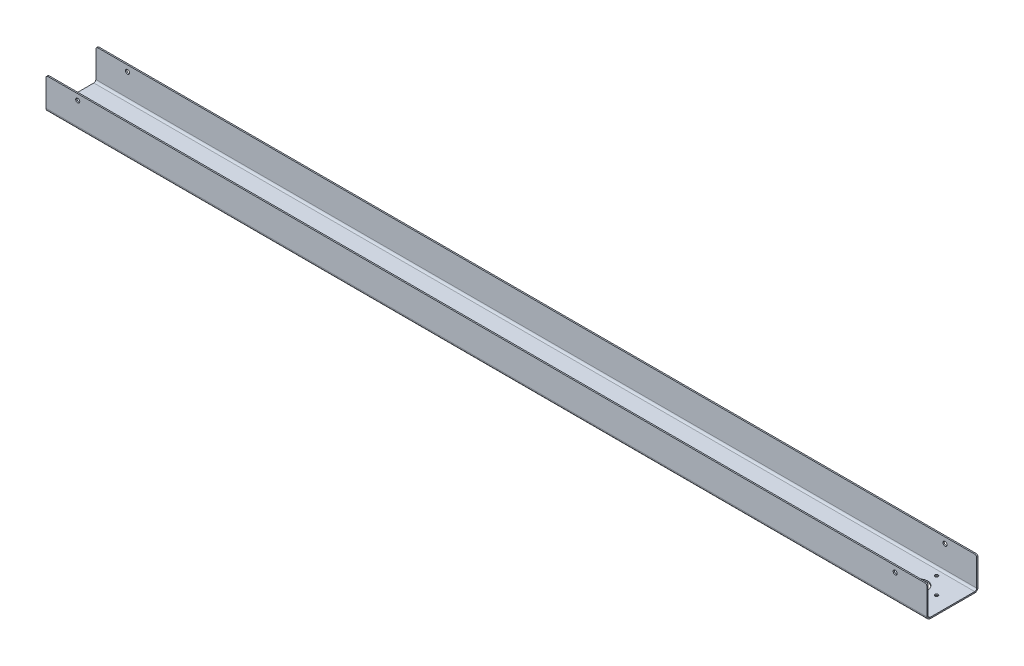
ISO-10303-21;
HEADER;
FILE_DESCRIPTION(('STEP AP214'),'2;1');
FILE_NAME('part.step','',(''),(''),'','','');
FILE_SCHEMA(('AUTOMOTIVE_DESIGN { 1 0 10303 214 1 1 1 1 }'));
ENDSEC;
DATA;
#1=APPLICATION_CONTEXT('core data for automotive mechanical design processes');
#2=APPLICATION_PROTOCOL_DEFINITION('international standard','automotive_design',2000,#1);
#3=PRODUCT_CONTEXT('',#1,'mechanical');
#4=PRODUCT('Part','Part','',(#3));
#5=PRODUCT_RELATED_PRODUCT_CATEGORY('part','',(#4));
#6=PRODUCT_DEFINITION_FORMATION('','',#4);
#7=PRODUCT_DEFINITION_CONTEXT('part definition',#1,'design');
#8=PRODUCT_DEFINITION('design','',#6,#7);
#9=PRODUCT_DEFINITION_SHAPE('','',#8);
#10=(LENGTH_UNIT() NAMED_UNIT(*) SI_UNIT(.MILLI.,.METRE.));
#11=(NAMED_UNIT(*) PLANE_ANGLE_UNIT() SI_UNIT($,.RADIAN.));
#12=(NAMED_UNIT(*) SI_UNIT($,.STERADIAN.) SOLID_ANGLE_UNIT());
#13=UNCERTAINTY_MEASURE_WITH_UNIT(LENGTH_MEASURE(1.E-05),#10,'distance_accuracy_value','');
#14=(GEOMETRIC_REPRESENTATION_CONTEXT(3) GLOBAL_UNCERTAINTY_ASSIGNED_CONTEXT((#13)) GLOBAL_UNIT_ASSIGNED_CONTEXT((#10,
#11,#12)) REPRESENTATION_CONTEXT('',''));
#15=CARTESIAN_POINT('',(0.,0.,0.));
#16=DIRECTION('',(0.,0.,1.));
#17=DIRECTION('',(1.,0.,0.));
#18=AXIS2_PLACEMENT_3D('',#15,#16,#17);
#19=CARTESIAN_POINT('',(0.,-2.052574,0.));
#20=DIRECTION('',(0.,-1.,0.));
#21=DIRECTION('',(0.,0.,-1.));
#22=AXIS2_PLACEMENT_3D('',#19,#20,#21);
#23=PLANE('',#22);
#24=CARTESIAN_POINT('',(1357.3125,-2.052574,-40.878125));
#25=DIRECTION('',(0.,-1.,0.));
#26=DIRECTION('',(0.,0.,-1.));
#27=AXIS2_PLACEMENT_3D('',#24,#25,#26);
#28=CIRCLE('',#27,12.6999999999999);
#29=CARTESIAN_POINT('',(1357.3125,-2.052574,-53.5781249999999));
#30=VERTEX_POINT('',#29);
#31=EDGE_CURVE('E847',#30,#30,#28,.T.);
#32=ORIENTED_EDGE('',*,*,#31,.F.);
#33=EDGE_LOOP('',(#32));
#34=FACE_BOUND('',#33,.T.);
#35=CARTESIAN_POINT('',(1384.3,-2.052574,-40.8781249999999));
#36=DIRECTION('',(0.,-1.,0.));
#37=DIRECTION('',(0.,0.,-1.));
#38=AXIS2_PLACEMENT_3D('',#35,#36,#37);
#39=CIRCLE('',#38,2.55270000000007);
#40=CARTESIAN_POINT('',(1384.3,-2.052574,-43.430825));
#41=VERTEX_POINT('',#40);
#42=EDGE_CURVE('E798',#41,#41,#39,.T.);
#43=ORIENTED_EDGE('',*,*,#42,.F.);
#44=EDGE_LOOP('',(#43));
#45=FACE_BOUND('',#44,.T.);
#46=CARTESIAN_POINT('',(1330.325,-2.052574,-40.878125));
#47=DIRECTION('',(0.,-1.,0.));
#48=DIRECTION('',(0.,0.,-1.));
#49=AXIS2_PLACEMENT_3D('',#46,#47,#48);
#50=CIRCLE('',#49,2.55270000000007);
#51=CARTESIAN_POINT('',(1330.325,-2.052574,-43.430825));
#52=VERTEX_POINT('',#51);
#53=EDGE_CURVE('E320',#52,#52,#50,.T.);
#54=ORIENTED_EDGE('',*,*,#53,.F.);
#55=EDGE_LOOP('',(#54));
#56=FACE_BOUND('',#55,.T.);
#57=CARTESIAN_POINT('',(1357.3125,-2.052574,-67.8656249999999));
#58=DIRECTION('',(0.,-1.,0.));
#59=DIRECTION('',(0.,0.,-1.));
#60=AXIS2_PLACEMENT_3D('',#57,#58,#59);
#61=CIRCLE('',#60,2.55270000000007);
#62=CARTESIAN_POINT('',(1357.3125,-2.052574,-70.418325));
#63=VERTEX_POINT('',#62);
#64=EDGE_CURVE('E319',#63,#63,#61,.T.);
#65=ORIENTED_EDGE('',*,*,#64,.F.);
#66=EDGE_LOOP('',(#65));
#67=FACE_BOUND('',#66,.T.);
#68=CARTESIAN_POINT('',(1357.3125,-2.052574,-13.890625));
#69=DIRECTION('',(0.,-1.,0.));
#70=DIRECTION('',(0.,0.,-1.));
#71=AXIS2_PLACEMENT_3D('',#68,#69,#70);
#72=CIRCLE('',#71,2.55270000000007);
#73=CARTESIAN_POINT('',(1357.3125,-2.052574,-16.4433250000001));
#74=VERTEX_POINT('',#73);
#75=EDGE_CURVE('E811',#74,#74,#72,.T.);
#76=ORIENTED_EDGE('',*,*,#75,.F.);
#77=EDGE_LOOP('',(#76));
#78=FACE_BOUND('',#77,.T.);
#79=DIRECTION('',(0.,0.,1.));
#80=VECTOR('',#79,1.);
#81=CARTESIAN_POINT('',(0.,-2.052574,0.));
#82=LINE('',#81,#80);
#83=CARTESIAN_POINT('',(0.,-2.05257400000005,-76.528676));
#84=VERTEX_POINT('',#83);
#85=CARTESIAN_POINT('',(0.,-2.052574,-5.22757399999961));
#86=VERTEX_POINT('',#85);
#87=EDGE_CURVE('E304',#84,#86,#82,.T.);
#88=ORIENTED_EDGE('',*,*,#87,.F.);
#89=DIRECTION('',(-1.,0.,0.));
#90=VECTOR('',#89,1.);
#91=CARTESIAN_POINT('',(0.,-2.05257400000005,-76.528676));
#92=LINE('',#91,#90);
#93=CARTESIAN_POINT('',(1409.7,-2.052574,-76.528676));
#94=VERTEX_POINT('',#93);
#95=EDGE_CURVE('E201',#84,#94,#92,.F.);
#96=ORIENTED_EDGE('',*,*,#95,.T.);
#97=DIRECTION('',(0.,0.,-1.));
#98=VECTOR('',#97,1.);
#99=CARTESIAN_POINT('',(1409.7,-2.052574,0.));
#100=LINE('',#99,#98);
#101=CARTESIAN_POINT('',(1409.7,-2.05257399999982,-5.22757399999987));
#102=VERTEX_POINT('',#101);
#103=EDGE_CURVE('E307',#102,#94,#100,.T.);
#104=ORIENTED_EDGE('',*,*,#103,.F.);
#105=DIRECTION('',(1.,0.,0.));
#106=VECTOR('',#105,1.);
#107=CARTESIAN_POINT('',(1409.7,-2.05257399999982,-5.22757399999987));
#108=LINE('',#107,#106);
#109=EDGE_CURVE('E281',#102,#86,#108,.F.);
#110=ORIENTED_EDGE('',*,*,#109,.T.);
#111=EDGE_LOOP('',(#88,#96,#104,#110));
#112=FACE_BOUND('',#111,.T.);
#113=ADVANCED_FACE('F78',(#34,#45,#56,#67,#78,#112),#23,.T.);
#114=CARTESIAN_POINT('',(0.,0.,0.));
#115=DIRECTION('',(0.,-1.,0.));
#116=DIRECTION('',(0.,0.,-1.));
#117=AXIS2_PLACEMENT_3D('',#114,#115,#116);
#118=PLANE('',#117);
#119=CARTESIAN_POINT('',(1357.3125,0.,-40.878125));
#120=DIRECTION('',(0.,-1.,0.));
#121=DIRECTION('',(0.,0.,-1.));
#122=AXIS2_PLACEMENT_3D('',#119,#120,#121);
#123=CIRCLE('',#122,12.6999999999999);
#124=CARTESIAN_POINT('',(1357.3125,0.,-53.5781249999999));
#125=VERTEX_POINT('',#124);
#126=EDGE_CURVE('E781',#125,#125,#123,.T.);
#127=ORIENTED_EDGE('',*,*,#126,.T.);
#128=EDGE_LOOP('',(#127));
#129=FACE_BOUND('',#128,.T.);
#130=CARTESIAN_POINT('',(1384.3,0.,-40.8781249999999));
#131=DIRECTION('',(0.,-1.,0.));
#132=DIRECTION('',(0.,0.,-1.));
#133=AXIS2_PLACEMENT_3D('',#130,#131,#132);
#134=CIRCLE('',#133,2.55270000000007);
#135=CARTESIAN_POINT('',(1384.3,0.,-43.430825));
#136=VERTEX_POINT('',#135);
#137=EDGE_CURVE('E801',#136,#136,#134,.T.);
#138=ORIENTED_EDGE('',*,*,#137,.T.);
#139=EDGE_LOOP('',(#138));
#140=FACE_BOUND('',#139,.T.);
#141=CARTESIAN_POINT('',(1330.325,0.,-40.878125));
#142=DIRECTION('',(0.,-1.,0.));
#143=DIRECTION('',(0.,0.,-1.));
#144=AXIS2_PLACEMENT_3D('',#141,#142,#143);
#145=CIRCLE('',#144,2.55270000000007);
#146=CARTESIAN_POINT('',(1330.325,0.,-43.430825));
#147=VERTEX_POINT('',#146);
#148=EDGE_CURVE('E316',#147,#147,#145,.T.);
#149=ORIENTED_EDGE('',*,*,#148,.T.);
#150=EDGE_LOOP('',(#149));
#151=FACE_BOUND('',#150,.T.);
#152=CARTESIAN_POINT('',(1357.3125,0.,-67.8656249999999));
#153=DIRECTION('',(0.,-1.,0.));
#154=DIRECTION('',(0.,0.,-1.));
#155=AXIS2_PLACEMENT_3D('',#152,#153,#154);
#156=CIRCLE('',#155,2.55270000000007);
#157=CARTESIAN_POINT('',(1357.3125,0.,-70.418325));
#158=VERTEX_POINT('',#157);
#159=EDGE_CURVE('E808',#158,#158,#156,.T.);
#160=ORIENTED_EDGE('',*,*,#159,.T.);
#161=EDGE_LOOP('',(#160));
#162=FACE_BOUND('',#161,.T.);
#163=CARTESIAN_POINT('',(1357.3125,0.,-13.890625));
#164=DIRECTION('',(0.,-1.,0.));
#165=DIRECTION('',(0.,0.,-1.));
#166=AXIS2_PLACEMENT_3D('',#163,#164,#165);
#167=CIRCLE('',#166,2.55270000000007);
#168=CARTESIAN_POINT('',(1357.3125,0.,-16.4433250000001));
#169=VERTEX_POINT('',#168);
#170=EDGE_CURVE('E239',#169,#169,#167,.T.);
#171=ORIENTED_EDGE('',*,*,#170,.T.);
#172=EDGE_LOOP('',(#171));
#173=FACE_BOUND('',#172,.T.);
#174=DIRECTION('',(-1.,0.,0.));
#175=VECTOR('',#174,1.);
#176=CARTESIAN_POINT('',(0.,0.,-76.528676));
#177=LINE('',#176,#175);
#178=CARTESIAN_POINT('',(0.,0.,-76.528676));
#179=VERTEX_POINT('',#178);
#180=CARTESIAN_POINT('',(1409.7,0.,-76.528676));
#181=VERTEX_POINT('',#180);
#182=EDGE_CURVE('E246',#179,#181,#177,.F.);
#183=ORIENTED_EDGE('',*,*,#182,.F.);
#184=DIRECTION('',(0.,0.,1.));
#185=VECTOR('',#184,1.);
#186=CARTESIAN_POINT('',(0.,0.,0.));
#187=LINE('',#186,#185);
#188=CARTESIAN_POINT('',(0.,1.81278603239576E-13,-5.22757399999961));
#189=VERTEX_POINT('',#188);
#190=EDGE_CURVE('E301',#179,#189,#187,.T.);
#191=ORIENTED_EDGE('',*,*,#190,.T.);
#192=DIRECTION('',(1.,0.,0.));
#193=VECTOR('',#192,1.);
#194=CARTESIAN_POINT('',(1409.7,1.81278603239576E-13,-5.22757399999999));
#195=LINE('',#194,#193);
#196=CARTESIAN_POINT('',(1409.7,1.81278603239576E-13,-5.22757399999999));
#197=VERTEX_POINT('',#196);
#198=EDGE_CURVE('E294',#197,#189,#195,.F.);
#199=ORIENTED_EDGE('',*,*,#198,.F.);
#200=DIRECTION('',(0.,0.,-1.));
#201=VECTOR('',#200,1.);
#202=CARTESIAN_POINT('',(1409.7,0.,0.));
#203=LINE('',#202,#201);
#204=EDGE_CURVE('E308',#197,#181,#203,.T.);
#205=ORIENTED_EDGE('',*,*,#204,.T.);
#206=EDGE_LOOP('',(#183,#191,#199,#205));
#207=FACE_BOUND('',#206,.T.);
#208=ADVANCED_FACE('F383',(#129,#140,#151,#162,#173,#207),#118,.F.);
#209=CARTESIAN_POINT('',(0.,-2.052574,0.));
#210=DIRECTION('',(-1.,0.,0.));
#211=DIRECTION('',(0.,0.,1.));
#212=AXIS2_PLACEMENT_3D('',#209,#210,#211);
#213=PLANE('',#212);
#214=ORIENTED_EDGE('',*,*,#190,.F.);
#215=DIRECTION('',(0.,-1.,0.));
#216=VECTOR('',#215,1.);
#217=CARTESIAN_POINT('',(0.,0.,-76.528676));
#218=LINE('',#217,#216);
#219=EDGE_CURVE('E242',#179,#84,#218,.T.);
#220=ORIENTED_EDGE('',*,*,#219,.T.);
#221=ORIENTED_EDGE('',*,*,#87,.T.);
#222=DIRECTION('',(0.,-1.,0.));
#223=VECTOR('',#222,1.);
#224=CARTESIAN_POINT('',(0.,1.81278603239576E-13,-5.22757399999961));
#225=LINE('',#224,#223);
#226=EDGE_CURVE('E298',#189,#86,#225,.T.);
#227=ORIENTED_EDGE('',*,*,#226,.F.);
#228=EDGE_LOOP('',(#214,#220,#221,#227));
#229=FACE_BOUND('',#228,.T.);
#230=ADVANCED_FACE('F437',(#229),#213,.T.);
#231=CARTESIAN_POINT('',(1409.7,-2.052574,0.));
#232=DIRECTION('',(1.,0.,0.));
#233=DIRECTION('',(0.,0.,-1.));
#234=AXIS2_PLACEMENT_3D('',#231,#232,#233);
#235=PLANE('',#234);
#236=DIRECTION('',(0.,-1.,0.));
#237=VECTOR('',#236,1.);
#238=CARTESIAN_POINT('',(1409.7,0.,-76.528676));
#239=LINE('',#238,#237);
#240=EDGE_CURVE('E249',#181,#94,#239,.T.);
#241=ORIENTED_EDGE('',*,*,#240,.F.);
#242=ORIENTED_EDGE('',*,*,#204,.F.);
#243=DIRECTION('',(0.,-1.,0.));
#244=VECTOR('',#243,1.);
#245=CARTESIAN_POINT('',(1409.7,1.81278603239576E-13,-5.22757399999999));
#246=LINE('',#245,#244);
#247=EDGE_CURVE('E288',#197,#102,#246,.T.);
#248=ORIENTED_EDGE('',*,*,#247,.T.);
#249=ORIENTED_EDGE('',*,*,#103,.T.);
#250=EDGE_LOOP('',(#241,#242,#248,#249));
#251=FACE_BOUND('',#250,.T.);
#252=ADVANCED_FACE('F379',(#251),#235,.T.);
#253=CARTESIAN_POINT('',(0.,3.17499999999999,-5.2275739999998));
#254=DIRECTION('',(-1.,0.,0.));
#255=DIRECTION('',(0.,0.,1.));
#256=AXIS2_PLACEMENT_3D('',#253,#254,#255);
#257=PLANE('',#256);
#258=DIRECTION('',(0.,0.,-1.));
#259=VECTOR('',#258,1.);
#260=CARTESIAN_POINT('',(0.,3.17499999999999,0.));
#261=LINE('',#260,#259);
#262=CARTESIAN_POINT('',(0.,3.17499999999999,-2.05257399999999));
#263=VERTEX_POINT('',#262);
#264=CARTESIAN_POINT('',(0.,3.17499999999999,0.));
#265=VERTEX_POINT('',#264);
#266=EDGE_CURVE('E252',#263,#265,#261,.F.);
#267=ORIENTED_EDGE('',*,*,#266,.F.);
#268=CARTESIAN_POINT('',(0.,3.17499999999999,-5.2275739999998));
#269=DIRECTION('',(1.,0.,0.));
#270=DIRECTION('',(0.,0.,-1.));
#271=AXIS2_PLACEMENT_3D('',#268,#269,#270);
#272=CIRCLE('',#271,3.17499999999981);
#273=EDGE_CURVE('E291',#189,#263,#272,.F.);
#274=ORIENTED_EDGE('',*,*,#273,.F.);
#275=ORIENTED_EDGE('',*,*,#226,.T.);
#276=CARTESIAN_POINT('',(0.,3.17499999999999,-5.2275739999998));
#277=DIRECTION('',(1.,0.,0.));
#278=DIRECTION('',(0.,0.,-1.));
#279=AXIS2_PLACEMENT_3D('',#276,#277,#278);
#280=CIRCLE('',#279,5.22757399999981);
#281=EDGE_CURVE('E284',#86,#265,#280,.F.);
#282=ORIENTED_EDGE('',*,*,#281,.T.);
#283=EDGE_LOOP('',(#267,#274,#275,#282));
#284=FACE_BOUND('',#283,.T.);
#285=ADVANCED_FACE('F393',(#284),#257,.T.);
#286=CARTESIAN_POINT('',(1409.7,3.17499999999999,-5.22757400000019));
#287=DIRECTION('',(-1.,0.,0.));
#288=DIRECTION('',(0.,0.,1.));
#289=AXIS2_PLACEMENT_3D('',#286,#287,#288);
#290=PLANE('',#289);
#291=CARTESIAN_POINT('',(1409.7,3.17499999999999,-5.22757400000019));
#292=DIRECTION('',(1.,0.,0.));
#293=DIRECTION('',(0.,0.,-1.));
#294=AXIS2_PLACEMENT_3D('',#291,#292,#293);
#295=CIRCLE('',#294,3.17499999999981);
#296=CARTESIAN_POINT('',(1409.7,3.17499999999999,-2.05257400000038));
#297=VERTEX_POINT('',#296);
#298=EDGE_CURVE('E257',#297,#197,#295,.T.);
#299=ORIENTED_EDGE('',*,*,#298,.F.);
#300=DIRECTION('',(0.,0.,-1.));
#301=VECTOR('',#300,1.);
#302=CARTESIAN_POINT('',(1409.7,3.17499999999999,-2.05257399999999));
#303=LINE('',#302,#301);
#304=CARTESIAN_POINT('',(1409.7,3.17499999999999,0.));
#305=VERTEX_POINT('',#304);
#306=EDGE_CURVE('E274',#297,#305,#303,.F.);
#307=ORIENTED_EDGE('',*,*,#306,.T.);
#308=CARTESIAN_POINT('',(1409.7,3.17499999999999,-5.22757400000019));
#309=DIRECTION('',(1.,0.,0.));
#310=DIRECTION('',(0.,0.,-1.));
#311=AXIS2_PLACEMENT_3D('',#308,#309,#310);
#312=CIRCLE('',#311,5.22757399999981);
#313=EDGE_CURVE('E285',#305,#102,#312,.T.);
#314=ORIENTED_EDGE('',*,*,#313,.T.);
#315=ORIENTED_EDGE('',*,*,#247,.F.);
#316=EDGE_LOOP('',(#299,#307,#314,#315));
#317=FACE_BOUND('',#316,.T.);
#318=ADVANCED_FACE('F405',(#317),#290,.F.);
#319=CARTESIAN_POINT('',(1409.7,3.17499999999999,-5.22757400000019));
#320=DIRECTION('',(1.,0.,0.));
#321=DIRECTION('',(0.,0.,1.));
#322=AXIS2_PLACEMENT_3D('',#319,#320,#321);
#323=CYLINDRICAL_SURFACE('',#322,5.22757399999981);
#324=ORIENTED_EDGE('',*,*,#109,.F.);
#325=ORIENTED_EDGE('',*,*,#313,.F.);
#326=DIRECTION('',(1.,0.,0.));
#327=VECTOR('',#326,1.);
#328=CARTESIAN_POINT('',(0.,3.17499999999999,0.));
#329=LINE('',#328,#327);
#330=EDGE_CURVE('E271',#305,#265,#329,.F.);
#331=ORIENTED_EDGE('',*,*,#330,.T.);
#332=ORIENTED_EDGE('',*,*,#281,.F.);
#333=EDGE_LOOP('',(#324,#325,#331,#332));
#334=FACE_BOUND('',#333,.T.);
#335=ADVANCED_FACE('F507',(#334),#323,.T.);
#336=CARTESIAN_POINT('',(1409.7,3.17499999999999,-5.22757400000019));
#337=DIRECTION('',(1.,0.,0.));
#338=DIRECTION('',(0.,0.,1.));
#339=AXIS2_PLACEMENT_3D('',#336,#337,#338);
#340=CYLINDRICAL_SURFACE('',#339,3.17499999999981);
#341=ORIENTED_EDGE('',*,*,#198,.T.);
#342=ORIENTED_EDGE('',*,*,#273,.T.);
#343=DIRECTION('',(1.,0.,0.));
#344=VECTOR('',#343,1.);
#345=CARTESIAN_POINT('',(0.,3.17499999999999,-2.05257399999999));
#346=LINE('',#345,#344);
#347=EDGE_CURVE('E277',#263,#297,#346,.T.);
#348=ORIENTED_EDGE('',*,*,#347,.T.);
#349=ORIENTED_EDGE('',*,*,#298,.T.);
#350=EDGE_LOOP('',(#341,#342,#348,#349));
#351=FACE_BOUND('',#350,.T.);
#352=ADVANCED_FACE('F388',(#351),#340,.F.);
#353=CARTESIAN_POINT('',(0.,0.,0.));
#354=DIRECTION('',(1.,0.,0.));
#355=DIRECTION('',(0.,0.,-1.));
#356=AXIS2_PLACEMENT_3D('',#353,#354,#355);
#357=PLANE('',#356);
#358=DIRECTION('',(0.,-1.,0.));
#359=VECTOR('',#358,1.);
#360=CARTESIAN_POINT('',(0.,0.,0.));
#361=LINE('',#360,#359);
#362=CARTESIAN_POINT('',(0.,45.572426,0.));
#363=VERTEX_POINT('',#362);
#364=EDGE_CURVE('E261',#363,#265,#361,.T.);
#365=ORIENTED_EDGE('',*,*,#364,.F.);
#366=DIRECTION('',(0.,0.,-1.));
#367=VECTOR('',#366,1.);
#368=CARTESIAN_POINT('',(0.,45.572426,0.));
#369=LINE('',#368,#367);
#370=CARTESIAN_POINT('',(0.,45.572426,-2.052574));
#371=VERTEX_POINT('',#370);
#372=EDGE_CURVE('E13',#363,#371,#369,.T.);
#373=ORIENTED_EDGE('',*,*,#372,.T.);
#374=DIRECTION('',(0.,1.,0.));
#375=VECTOR('',#374,1.);
#376=CARTESIAN_POINT('',(0.,0.,-2.052574));
#377=LINE('',#376,#375);
#378=EDGE_CURVE('E269',#371,#263,#377,.F.);
#379=ORIENTED_EDGE('',*,*,#378,.T.);
#380=ORIENTED_EDGE('',*,*,#266,.T.);
#381=EDGE_LOOP('',(#365,#373,#379,#380));
#382=FACE_BOUND('',#381,.T.);
#383=ADVANCED_FACE('F396',(#382),#357,.F.);
#384=CARTESIAN_POINT('',(1409.7,48.747426,0.));
#385=DIRECTION('',(-1.,0.,0.));
#386=DIRECTION('',(0.,0.,1.));
#387=AXIS2_PLACEMENT_3D('',#384,#385,#386);
#388=PLANE('',#387);
#389=DIRECTION('',(0.,-1.,0.));
#390=VECTOR('',#389,1.);
#391=CARTESIAN_POINT('',(1409.7,48.747426,-2.052574));
#392=LINE('',#391,#390);
#393=CARTESIAN_POINT('',(1409.7,45.572426,-2.052574));
#394=VERTEX_POINT('',#393);
#395=EDGE_CURVE('E266',#297,#394,#392,.F.);
#396=ORIENTED_EDGE('',*,*,#395,.T.);
#397=DIRECTION('',(0.,0.,-1.));
#398=VECTOR('',#397,1.);
#399=CARTESIAN_POINT('',(1409.7,45.572426,0.));
#400=LINE('',#399,#398);
#401=CARTESIAN_POINT('',(1409.7,45.572426,0.));
#402=VERTEX_POINT('',#401);
#403=EDGE_CURVE('E334',#394,#402,#400,.F.);
#404=ORIENTED_EDGE('',*,*,#403,.T.);
#405=DIRECTION('',(0.,1.,0.));
#406=VECTOR('',#405,1.);
#407=CARTESIAN_POINT('',(1409.7,0.,0.));
#408=LINE('',#407,#406);
#409=EDGE_CURVE('E258',#305,#402,#408,.T.);
#410=ORIENTED_EDGE('',*,*,#409,.F.);
#411=ORIENTED_EDGE('',*,*,#306,.F.);
#412=EDGE_LOOP('',(#396,#404,#410,#411));
#413=FACE_BOUND('',#412,.T.);
#414=ADVANCED_FACE('F409',(#413),#388,.F.);
#415=CARTESIAN_POINT('',(0.,0.,0.));
#416=DIRECTION('',(0.,0.,-1.));
#417=DIRECTION('',(-1.,0.,0.));
#418=AXIS2_PLACEMENT_3D('',#415,#416,#417);
#419=PLANE('',#418);
#420=CARTESIAN_POINT('',(1358.9,39.222426,0.));
#421=DIRECTION('',(0.,0.,1.));
#422=DIRECTION('',(1.,0.,0.));
#423=AXIS2_PLACEMENT_3D('',#420,#421,#422);
#424=CIRCLE('',#423,3.2639000000001);
#425=CARTESIAN_POINT('',(1362.1639,39.222426,0.));
#426=VERTEX_POINT('',#425);
#427=EDGE_CURVE('E778',#426,#426,#424,.T.);
#428=ORIENTED_EDGE('',*,*,#427,.F.);
#429=EDGE_LOOP('',(#428));
#430=FACE_BOUND('',#429,.T.);
#431=CARTESIAN_POINT('',(50.8,39.222426,0.));
#432=DIRECTION('',(0.,0.,1.));
#433=DIRECTION('',(1.,0.,0.));
#434=AXIS2_PLACEMENT_3D('',#431,#432,#433);
#435=CIRCLE('',#434,3.2639);
#436=CARTESIAN_POINT('',(54.0639,39.222426,0.));
#437=VERTEX_POINT('',#436);
#438=EDGE_CURVE('E786',#437,#437,#435,.T.);
#439=ORIENTED_EDGE('',*,*,#438,.F.);
#440=EDGE_LOOP('',(#439));
#441=FACE_BOUND('',#440,.T.);
#442=ORIENTED_EDGE('',*,*,#409,.T.);
#443=CARTESIAN_POINT('',(1406.525,45.572426,0.));
#444=DIRECTION('',(0.,0.,-1.));
#445=DIRECTION('',(-1.,0.,0.));
#446=AXIS2_PLACEMENT_3D('',#443,#444,#445);
#447=CIRCLE('',#446,3.175);
#448=CARTESIAN_POINT('',(1406.525,48.747426,0.));
#449=VERTEX_POINT('',#448);
#450=EDGE_CURVE('E338',#402,#449,#447,.F.);
#451=ORIENTED_EDGE('',*,*,#450,.T.);
#452=DIRECTION('',(-1.,0.,0.));
#453=VECTOR('',#452,1.);
#454=CARTESIAN_POINT('',(0.,48.747426,0.));
#455=LINE('',#454,#453);
#456=CARTESIAN_POINT('',(3.175,48.747426,0.));
#457=VERTEX_POINT('',#456);
#458=EDGE_CURVE('E254',#449,#457,#455,.T.);
#459=ORIENTED_EDGE('',*,*,#458,.T.);
#460=CARTESIAN_POINT('',(3.175,45.572426,0.));
#461=DIRECTION('',(0.,0.,-1.));
#462=DIRECTION('',(-1.,0.,0.));
#463=AXIS2_PLACEMENT_3D('',#460,#461,#462);
#464=CIRCLE('',#463,3.175);
#465=EDGE_CURVE('E336',#457,#363,#464,.F.);
#466=ORIENTED_EDGE('',*,*,#465,.T.);
#467=ORIENTED_EDGE('',*,*,#364,.T.);
#468=ORIENTED_EDGE('',*,*,#330,.F.);
#469=EDGE_LOOP('',(#442,#451,#459,#466,#467,#468));
#470=FACE_BOUND('',#469,.T.);
#471=ADVANCED_FACE('F413',(#430,#441,#470),#419,.F.);
#472=CARTESIAN_POINT('',(0.,0.,-2.052574));
#473=DIRECTION('',(0.,0.,-1.));
#474=DIRECTION('',(-1.,0.,0.));
#475=AXIS2_PLACEMENT_3D('',#472,#473,#474);
#476=PLANE('',#475);
#477=CARTESIAN_POINT('',(1358.9,39.222426,-2.052574));
#478=DIRECTION('',(0.,0.,-1.));
#479=DIRECTION('',(-1.,0.,0.));
#480=AXIS2_PLACEMENT_3D('',#477,#478,#479);
#481=CIRCLE('',#480,3.26389999999999);
#482=CARTESIAN_POINT('',(1355.6361,39.222426,-2.052574));
#483=VERTEX_POINT('',#482);
#484=EDGE_CURVE('E321',#483,#483,#481,.T.);
#485=ORIENTED_EDGE('',*,*,#484,.F.);
#486=EDGE_LOOP('',(#485));
#487=FACE_BOUND('',#486,.T.);
#488=CARTESIAN_POINT('',(50.8,39.222426,-2.052574));
#489=DIRECTION('',(0.,0.,-1.));
#490=DIRECTION('',(-1.,0.,0.));
#491=AXIS2_PLACEMENT_3D('',#488,#489,#490);
#492=CIRCLE('',#491,3.26389999999999);
#493=CARTESIAN_POINT('',(47.5361,39.222426,-2.052574));
#494=VERTEX_POINT('',#493);
#495=EDGE_CURVE('E792',#494,#494,#492,.T.);
#496=ORIENTED_EDGE('',*,*,#495,.F.);
#497=EDGE_LOOP('',(#496));
#498=FACE_BOUND('',#497,.T.);
#499=DIRECTION('',(1.,0.,0.));
#500=VECTOR('',#499,1.);
#501=CARTESIAN_POINT('',(0.,48.747426,-2.052574));
#502=LINE('',#501,#500);
#503=CARTESIAN_POINT('',(1406.525,48.747426,-2.052574));
#504=VERTEX_POINT('',#503);
#505=CARTESIAN_POINT('',(3.175,48.747426,-2.052574));
#506=VERTEX_POINT('',#505);
#507=EDGE_CURVE('E263',#504,#506,#502,.F.);
#508=ORIENTED_EDGE('',*,*,#507,.F.);
#509=CARTESIAN_POINT('',(1406.525,45.572426,-2.052574));
#510=DIRECTION('',(0.,0.,-1.));
#511=DIRECTION('',(-1.,0.,0.));
#512=AXIS2_PLACEMENT_3D('',#509,#510,#511);
#513=CIRCLE('',#512,3.175);
#514=EDGE_CURVE('E332',#504,#394,#513,.T.);
#515=ORIENTED_EDGE('',*,*,#514,.T.);
#516=ORIENTED_EDGE('',*,*,#395,.F.);
#517=ORIENTED_EDGE('',*,*,#347,.F.);
#518=ORIENTED_EDGE('',*,*,#378,.F.);
#519=CARTESIAN_POINT('',(3.175,45.572426,-2.052574));
#520=DIRECTION('',(0.,0.,-1.));
#521=DIRECTION('',(-1.,0.,0.));
#522=AXIS2_PLACEMENT_3D('',#519,#520,#521);
#523=CIRCLE('',#522,3.175);
#524=EDGE_CURVE('E330',#371,#506,#523,.T.);
#525=ORIENTED_EDGE('',*,*,#524,.T.);
#526=EDGE_LOOP('',(#508,#515,#516,#517,#518,#525));
#527=FACE_BOUND('',#526,.T.);
#528=ADVANCED_FACE('F401',(#487,#498,#527),#476,.T.);
#529=CARTESIAN_POINT('',(0.,48.747426,0.));
#530=DIRECTION('',(0.,-1.,0.));
#531=DIRECTION('',(0.,0.,-1.));
#532=AXIS2_PLACEMENT_3D('',#529,#530,#531);
#533=PLANE('',#532);
#534=ORIENTED_EDGE('',*,*,#458,.F.);
#535=DIRECTION('',(0.,0.,-1.));
#536=VECTOR('',#535,1.);
#537=CARTESIAN_POINT('',(1406.525,48.747426,0.));
#538=LINE('',#537,#536);
#539=EDGE_CURVE('E327',#449,#504,#538,.T.);
#540=ORIENTED_EDGE('',*,*,#539,.T.);
#541=ORIENTED_EDGE('',*,*,#507,.T.);
#542=DIRECTION('',(0.,0.,-1.));
#543=VECTOR('',#542,1.);
#544=CARTESIAN_POINT('',(3.175,48.747426,0.));
#545=LINE('',#544,#543);
#546=EDGE_CURVE('E311',#506,#457,#545,.F.);
#547=ORIENTED_EDGE('',*,*,#546,.T.);
#548=EDGE_LOOP('',(#534,#540,#541,#547));
#549=FACE_BOUND('',#548,.T.);
#550=ADVANCED_FACE('F419',(#549),#533,.F.);
#551=CARTESIAN_POINT('',(1409.7,3.17499999999995,-76.528676));
#552=DIRECTION('',(1.,0.,0.));
#553=DIRECTION('',(0.,0.,-1.));
#554=AXIS2_PLACEMENT_3D('',#551,#552,#553);
#555=PLANE('',#554);
#556=DIRECTION('',(0.,0.,1.));
#557=VECTOR('',#556,1.);
#558=CARTESIAN_POINT('',(1409.7,3.175,-81.75625));
#559=LINE('',#558,#557);
#560=CARTESIAN_POINT('',(1409.7,3.17499999999994,-79.703676));
#561=VERTEX_POINT('',#560);
#562=CARTESIAN_POINT('',(1409.7,3.17499999999993,-81.75625));
#563=VERTEX_POINT('',#562);
#564=EDGE_CURVE('E236',#561,#563,#559,.F.);
#565=ORIENTED_EDGE('',*,*,#564,.F.);
#566=CARTESIAN_POINT('',(1409.7,3.17499999999995,-76.528676));
#567=DIRECTION('',(-1.,0.,0.));
#568=DIRECTION('',(0.,0.,1.));
#569=AXIS2_PLACEMENT_3D('',#566,#567,#568);
#570=CIRCLE('',#569,3.175);
#571=EDGE_CURVE('E204',#181,#561,#570,.F.);
#572=ORIENTED_EDGE('',*,*,#571,.F.);
#573=ORIENTED_EDGE('',*,*,#240,.T.);
#574=CARTESIAN_POINT('',(1409.7,3.17499999999995,-76.528676));
#575=DIRECTION('',(-1.,0.,0.));
#576=DIRECTION('',(0.,0.,1.));
#577=AXIS2_PLACEMENT_3D('',#574,#575,#576);
#578=CIRCLE('',#577,5.227574);
#579=EDGE_CURVE('E241',#94,#563,#578,.F.);
#580=ORIENTED_EDGE('',*,*,#579,.T.);
#581=EDGE_LOOP('',(#565,#572,#573,#580));
#582=FACE_BOUND('',#581,.T.);
#583=ADVANCED_FACE('F376',(#582),#555,.T.);
#584=CARTESIAN_POINT('',(0.,3.17499999999995,-76.528676));
#585=DIRECTION('',(1.,0.,0.));
#586=DIRECTION('',(0.,0.,-1.));
#587=AXIS2_PLACEMENT_3D('',#584,#585,#586);
#588=PLANE('',#587);
#589=CARTESIAN_POINT('',(0.,3.17499999999995,-76.528676));
#590=DIRECTION('',(-1.,0.,0.));
#591=DIRECTION('',(0.,0.,1.));
#592=AXIS2_PLACEMENT_3D('',#589,#590,#591);
#593=CIRCLE('',#592,3.175);
#594=CARTESIAN_POINT('',(0.,3.17499999999994,-79.703676));
#595=VERTEX_POINT('',#594);
#596=EDGE_CURVE('E211',#595,#179,#593,.T.);
#597=ORIENTED_EDGE('',*,*,#596,.F.);
#598=DIRECTION('',(0.,0.,1.));
#599=VECTOR('',#598,1.);
#600=CARTESIAN_POINT('',(0.,3.17499999999996,-79.703676));
#601=LINE('',#600,#599);
#602=CARTESIAN_POINT('',(0.,3.17499999999997,-81.75625));
#603=VERTEX_POINT('',#602);
#604=EDGE_CURVE('E208',#595,#603,#601,.F.);
#605=ORIENTED_EDGE('',*,*,#604,.T.);
#606=CARTESIAN_POINT('',(0.,3.17499999999995,-76.528676));
#607=DIRECTION('',(-1.,0.,0.));
#608=DIRECTION('',(0.,0.,1.));
#609=AXIS2_PLACEMENT_3D('',#606,#607,#608);
#610=CIRCLE('',#609,5.227574);
#611=EDGE_CURVE('E194',#603,#84,#610,.T.);
#612=ORIENTED_EDGE('',*,*,#611,.T.);
#613=ORIENTED_EDGE('',*,*,#219,.F.);
#614=EDGE_LOOP('',(#597,#605,#612,#613));
#615=FACE_BOUND('',#614,.T.);
#616=ADVANCED_FACE('F209',(#615),#588,.F.);
#617=CARTESIAN_POINT('',(0.,3.17499999999995,-76.528676));
#618=DIRECTION('',(-1.,0.,0.));
#619=DIRECTION('',(0.,0.,-1.));
#620=AXIS2_PLACEMENT_3D('',#617,#618,#619);
#621=CYLINDRICAL_SURFACE('',#620,5.227574);
#622=ORIENTED_EDGE('',*,*,#95,.F.);
#623=ORIENTED_EDGE('',*,*,#611,.F.);
#624=DIRECTION('',(-1.,0.,0.));
#625=VECTOR('',#624,1.);
#626=CARTESIAN_POINT('',(1409.7,3.175,-81.75625));
#627=LINE('',#626,#625);
#628=EDGE_CURVE('E198',#603,#563,#627,.F.);
#629=ORIENTED_EDGE('',*,*,#628,.T.);
#630=ORIENTED_EDGE('',*,*,#579,.F.);
#631=EDGE_LOOP('',(#622,#623,#629,#630));
#632=FACE_BOUND('',#631,.T.);
#633=ADVANCED_FACE('F196',(#632),#621,.T.);
#634=CARTESIAN_POINT('',(0.,3.17499999999995,-76.528676));
#635=DIRECTION('',(-1.,0.,0.));
#636=DIRECTION('',(0.,0.,-1.));
#637=AXIS2_PLACEMENT_3D('',#634,#635,#636);
#638=CYLINDRICAL_SURFACE('',#637,3.175);
#639=ORIENTED_EDGE('',*,*,#182,.T.);
#640=ORIENTED_EDGE('',*,*,#571,.T.);
#641=DIRECTION('',(-1.,0.,0.));
#642=VECTOR('',#641,1.);
#643=CARTESIAN_POINT('',(1409.7,3.17499999999998,-79.703676));
#644=LINE('',#643,#642);
#645=EDGE_CURVE('E213',#561,#595,#644,.T.);
#646=ORIENTED_EDGE('',*,*,#645,.T.);
#647=ORIENTED_EDGE('',*,*,#596,.T.);
#648=EDGE_LOOP('',(#639,#640,#646,#647));
#649=FACE_BOUND('',#648,.T.);
#650=ADVANCED_FACE('F371',(#649),#638,.F.);
#651=CARTESIAN_POINT('',(1409.7,0.,-81.75625));
#652=DIRECTION('',(-1.,0.,0.));
#653=DIRECTION('',(0.,0.,1.));
#654=AXIS2_PLACEMENT_3D('',#651,#652,#653);
#655=PLANE('',#654);
#656=DIRECTION('',(0.,-1.,0.));
#657=VECTOR('',#656,1.);
#658=CARTESIAN_POINT('',(1409.7,-2.86466412873307E-13,-81.75625));
#659=LINE('',#658,#657);
#660=CARTESIAN_POINT('',(1409.7,45.572426,-81.7562500000002));
#661=VERTEX_POINT('',#660);
#662=EDGE_CURVE('E220',#661,#563,#659,.T.);
#663=ORIENTED_EDGE('',*,*,#662,.F.);
#664=DIRECTION('',(0.,0.,1.));
#665=VECTOR('',#664,1.);
#666=CARTESIAN_POINT('',(1409.7,45.572426,-81.7562500000002));
#667=LINE('',#666,#665);
#668=CARTESIAN_POINT('',(1409.7,45.572426,-79.7036760000002));
#669=VERTEX_POINT('',#668);
#670=EDGE_CURVE('E340',#661,#669,#667,.T.);
#671=ORIENTED_EDGE('',*,*,#670,.T.);
#672=DIRECTION('',(0.,1.,0.));
#673=VECTOR('',#672,1.);
#674=CARTESIAN_POINT('',(1409.7,0.,-79.703676));
#675=LINE('',#674,#673);
#676=EDGE_CURVE('E221',#669,#561,#675,.F.);
#677=ORIENTED_EDGE('',*,*,#676,.T.);
#678=ORIENTED_EDGE('',*,*,#564,.T.);
#679=EDGE_LOOP('',(#663,#671,#677,#678));
#680=FACE_BOUND('',#679,.T.);
#681=ADVANCED_FACE('F358',(#680),#655,.F.);
#682=CARTESIAN_POINT('',(4.44089209850063E-13,48.747426,-81.7562500000002));
#683=DIRECTION('',(1.,0.,0.));
#684=DIRECTION('',(0.,1.,0.));
#685=AXIS2_PLACEMENT_3D('',#682,#683,#684);
#686=PLANE('',#685);
#687=DIRECTION('',(0.,-1.,0.));
#688=VECTOR('',#687,1.);
#689=CARTESIAN_POINT('',(4.44089209850063E-13,48.747426,-79.7036760000002));
#690=LINE('',#689,#688);
#691=CARTESIAN_POINT('',(4.15164949494779E-13,45.572426,-79.7036760000002));
#692=VERTEX_POINT('',#691);
#693=EDGE_CURVE('E232',#595,#692,#690,.F.);
#694=ORIENTED_EDGE('',*,*,#693,.T.);
#695=DIRECTION('',(0.,0.,1.));
#696=VECTOR('',#695,1.);
#697=CARTESIAN_POINT('',(4.15164949494779E-13,45.572426,-81.7562500000002));
#698=LINE('',#697,#696);
#699=CARTESIAN_POINT('',(4.15164949494781E-13,45.572426,-81.7562500000002));
#700=VERTEX_POINT('',#699);
#701=EDGE_CURVE('E86',#692,#700,#698,.F.);
#702=ORIENTED_EDGE('',*,*,#701,.T.);
#703=DIRECTION('',(0.,1.,0.));
#704=VECTOR('',#703,1.);
#705=CARTESIAN_POINT('',(0.,-2.86466412873307E-13,-81.75625));
#706=LINE('',#705,#704);
#707=EDGE_CURVE('E217',#603,#700,#706,.T.);
#708=ORIENTED_EDGE('',*,*,#707,.F.);
#709=ORIENTED_EDGE('',*,*,#604,.F.);
#710=EDGE_LOOP('',(#694,#702,#708,#709));
#711=FACE_BOUND('',#710,.T.);
#712=ADVANCED_FACE('F223',(#711),#686,.F.);
#713=CARTESIAN_POINT('',(0.,-2.86466412873307E-13,-81.75625));
#714=DIRECTION('',(0.,0.,1.));
#715=DIRECTION('',(0.,-1.,0.));
#716=AXIS2_PLACEMENT_3D('',#713,#714,#715);
#717=PLANE('',#716);
#718=CARTESIAN_POINT('',(1358.9,39.222426,-81.7562500000002));
#719=DIRECTION('',(0.,0.,1.));
#720=DIRECTION('',(1.,0.,0.));
#721=AXIS2_PLACEMENT_3D('',#718,#719,#720);
#722=CIRCLE('',#721,3.26389999999988);
#723=CARTESIAN_POINT('',(1362.1639,39.222426,-81.7562500000002));
#724=VERTEX_POINT('',#723);
#725=EDGE_CURVE('E325',#724,#724,#722,.T.);
#726=ORIENTED_EDGE('',*,*,#725,.T.);
#727=EDGE_LOOP('',(#726));
#728=FACE_BOUND('',#727,.T.);
#729=CARTESIAN_POINT('',(50.8,39.222426,-81.7562500000002));
#730=DIRECTION('',(0.,0.,1.));
#731=DIRECTION('',(1.,0.,0.));
#732=AXIS2_PLACEMENT_3D('',#729,#730,#731);
#733=CIRCLE('',#732,3.26389999999998);
#734=CARTESIAN_POINT('',(54.0638999999999,39.222426,-81.7562500000002));
#735=VERTEX_POINT('',#734);
#736=EDGE_CURVE('E789',#735,#735,#733,.T.);
#737=ORIENTED_EDGE('',*,*,#736,.T.);
#738=EDGE_LOOP('',(#737));
#739=FACE_BOUND('',#738,.T.);
#740=DIRECTION('',(1.,0.,0.));
#741=VECTOR('',#740,1.);
#742=CARTESIAN_POINT('',(0.,48.747426,-81.7562500000002));
#743=LINE('',#742,#741);
#744=CARTESIAN_POINT('',(3.17500000000037,48.747426,-81.7562500000002));
#745=VERTEX_POINT('',#744);
#746=CARTESIAN_POINT('',(1406.525,48.747426,-81.7562500000002));
#747=VERTEX_POINT('',#746);
#748=EDGE_CURVE('E224',#745,#747,#743,.T.);
#749=ORIENTED_EDGE('',*,*,#748,.T.);
#750=CARTESIAN_POINT('',(1406.525,45.572426,-81.7562500000002));
#751=DIRECTION('',(0.,0.,1.));
#752=DIRECTION('',(0.,-1.,0.));
#753=AXIS2_PLACEMENT_3D('',#750,#751,#752);
#754=CIRCLE('',#753,3.175);
#755=EDGE_CURVE('E353',#747,#661,#754,.F.);
#756=ORIENTED_EDGE('',*,*,#755,.T.);
#757=ORIENTED_EDGE('',*,*,#662,.T.);
#758=ORIENTED_EDGE('',*,*,#628,.F.);
#759=ORIENTED_EDGE('',*,*,#707,.T.);
#760=CARTESIAN_POINT('',(3.17500000000037,45.572426,-81.7562500000002));
#761=DIRECTION('',(0.,0.,1.));
#762=DIRECTION('',(0.,-1.,0.));
#763=AXIS2_PLACEMENT_3D('',#760,#761,#762);
#764=CIRCLE('',#763,3.175);
#765=EDGE_CURVE('E351',#700,#745,#764,.F.);
#766=ORIENTED_EDGE('',*,*,#765,.T.);
#767=EDGE_LOOP('',(#749,#756,#757,#758,#759,#766));
#768=FACE_BOUND('',#767,.T.);
#769=ADVANCED_FACE('F216',(#728,#739,#768),#717,.F.);
#770=CARTESIAN_POINT('',(0.,-2.79299889055713E-13,-79.703676));
#771=DIRECTION('',(0.,0.,1.));
#772=DIRECTION('',(0.,-1.,0.));
#773=AXIS2_PLACEMENT_3D('',#770,#771,#772);
#774=PLANE('',#773);
#775=CARTESIAN_POINT('',(1358.9,39.222426,-79.7036760000001));
#776=DIRECTION('',(0.,0.,1.));
#777=DIRECTION('',(0.,-1.,0.));
#778=AXIS2_PLACEMENT_3D('',#775,#776,#777);
#779=CIRCLE('',#778,3.26389999999999);
#780=CARTESIAN_POINT('',(1358.9,35.958526,-79.7036760000001));
#781=VERTEX_POINT('',#780);
#782=EDGE_CURVE('E324',#781,#781,#779,.T.);
#783=ORIENTED_EDGE('',*,*,#782,.F.);
#784=EDGE_LOOP('',(#783));
#785=FACE_BOUND('',#784,.T.);
#786=CARTESIAN_POINT('',(50.8,39.222426,-79.7036760000001));
#787=DIRECTION('',(0.,0.,1.));
#788=DIRECTION('',(0.,-1.,0.));
#789=AXIS2_PLACEMENT_3D('',#786,#787,#788);
#790=CIRCLE('',#789,3.26389999999999);
#791=CARTESIAN_POINT('',(50.8,35.958526,-79.7036760000001));
#792=VERTEX_POINT('',#791);
#793=EDGE_CURVE('E795',#792,#792,#790,.T.);
#794=ORIENTED_EDGE('',*,*,#793,.F.);
#795=EDGE_LOOP('',(#794));
#796=FACE_BOUND('',#795,.T.);
#797=ORIENTED_EDGE('',*,*,#676,.F.);
#798=CARTESIAN_POINT('',(1406.525,45.572426,-79.7036760000002));
#799=DIRECTION('',(0.,0.,1.));
#800=DIRECTION('',(0.,-1.,0.));
#801=AXIS2_PLACEMENT_3D('',#798,#799,#800);
#802=CIRCLE('',#801,3.175);
#803=CARTESIAN_POINT('',(1406.525,48.747426,-79.7036760000002));
#804=VERTEX_POINT('',#803);
#805=EDGE_CURVE('E345',#669,#804,#802,.T.);
#806=ORIENTED_EDGE('',*,*,#805,.T.);
#807=DIRECTION('',(-1.,0.,0.));
#808=VECTOR('',#807,1.);
#809=CARTESIAN_POINT('',(1409.7,48.747426,-79.7036760000002));
#810=LINE('',#809,#808);
#811=CARTESIAN_POINT('',(3.17500000000037,48.747426,-79.7036760000002));
#812=VERTEX_POINT('',#811);
#813=EDGE_CURVE('E227',#812,#804,#810,.F.);
#814=ORIENTED_EDGE('',*,*,#813,.F.);
#815=CARTESIAN_POINT('',(3.17500000000037,45.572426,-79.7036760000002));
#816=DIRECTION('',(0.,0.,1.));
#817=DIRECTION('',(0.,-1.,0.));
#818=AXIS2_PLACEMENT_3D('',#815,#816,#817);
#819=CIRCLE('',#818,3.175);
#820=EDGE_CURVE('E343',#812,#692,#819,.T.);
#821=ORIENTED_EDGE('',*,*,#820,.T.);
#822=ORIENTED_EDGE('',*,*,#693,.F.);
#823=ORIENTED_EDGE('',*,*,#645,.F.);
#824=EDGE_LOOP('',(#797,#806,#814,#821,#822,#823));
#825=FACE_BOUND('',#824,.T.);
#826=ADVANCED_FACE('F364',(#785,#796,#825),#774,.T.);
#827=CARTESIAN_POINT('',(1409.7,48.747426,-81.7562500000002));
#828=DIRECTION('',(0.,-1.,0.));
#829=DIRECTION('',(0.,0.,-1.));
#830=AXIS2_PLACEMENT_3D('',#827,#828,#829);
#831=PLANE('',#830);
#832=ORIENTED_EDGE('',*,*,#813,.T.);
#833=DIRECTION('',(0.,0.,1.));
#834=VECTOR('',#833,1.);
#835=CARTESIAN_POINT('',(1406.525,48.747426,-81.7562500000002));
#836=LINE('',#835,#834);
#837=EDGE_CURVE('E100',#804,#747,#836,.F.);
#838=ORIENTED_EDGE('',*,*,#837,.T.);
#839=ORIENTED_EDGE('',*,*,#748,.F.);
#840=DIRECTION('',(0.,0.,1.));
#841=VECTOR('',#840,1.);
#842=CARTESIAN_POINT('',(3.17500000000037,48.747426,-81.7562500000002));
#843=LINE('',#842,#841);
#844=EDGE_CURVE('E347',#745,#812,#843,.T.);
#845=ORIENTED_EDGE('',*,*,#844,.T.);
#846=EDGE_LOOP('',(#832,#838,#839,#845));
#847=FACE_BOUND('',#846,.T.);
#848=ADVANCED_FACE('F366',(#847),#831,.F.);
#849=CARTESIAN_POINT('',(1357.3125,-2.052574,-13.890625));
#850=DIRECTION('',(0.,-1.,0.));
#851=DIRECTION('',(0.,0.,-1.));
#852=AXIS2_PLACEMENT_3D('',#849,#850,#851);
#853=CYLINDRICAL_SURFACE('',#852,2.55270000000007);
#854=ORIENTED_EDGE('',*,*,#75,.T.);
#855=EDGE_LOOP('',(#854));
#856=FACE_BOUND('',#855,.T.);
#857=ORIENTED_EDGE('',*,*,#170,.F.);
#858=EDGE_LOOP('',(#857));
#859=FACE_BOUND('',#858,.T.);
#860=ADVANCED_FACE('F610',(#856,#859),#853,.F.);
#861=CARTESIAN_POINT('',(1357.3125,-2.052574,-67.8656249999999));
#862=DIRECTION('',(0.,-1.,0.));
#863=DIRECTION('',(0.,0.,-1.));
#864=AXIS2_PLACEMENT_3D('',#861,#862,#863);
#865=CYLINDRICAL_SURFACE('',#864,2.55270000000007);
#866=ORIENTED_EDGE('',*,*,#64,.T.);
#867=EDGE_LOOP('',(#866));
#868=FACE_BOUND('',#867,.T.);
#869=ORIENTED_EDGE('',*,*,#159,.F.);
#870=EDGE_LOOP('',(#869));
#871=FACE_BOUND('',#870,.T.);
#872=ADVANCED_FACE('F616',(#868,#871),#865,.F.);
#873=CARTESIAN_POINT('',(1330.325,-2.052574,-40.878125));
#874=DIRECTION('',(0.,-1.,0.));
#875=DIRECTION('',(0.,0.,-1.));
#876=AXIS2_PLACEMENT_3D('',#873,#874,#875);
#877=CYLINDRICAL_SURFACE('',#876,2.55270000000007);
#878=ORIENTED_EDGE('',*,*,#53,.T.);
#879=EDGE_LOOP('',(#878));
#880=FACE_BOUND('',#879,.T.);
#881=ORIENTED_EDGE('',*,*,#148,.F.);
#882=EDGE_LOOP('',(#881));
#883=FACE_BOUND('',#882,.T.);
#884=ADVANCED_FACE('F624',(#880,#883),#877,.F.);
#885=CARTESIAN_POINT('',(1384.3,-2.052574,-40.8781249999999));
#886=DIRECTION('',(0.,-1.,0.));
#887=DIRECTION('',(0.,0.,-1.));
#888=AXIS2_PLACEMENT_3D('',#885,#886,#887);
#889=CYLINDRICAL_SURFACE('',#888,2.55270000000007);
#890=ORIENTED_EDGE('',*,*,#42,.T.);
#891=EDGE_LOOP('',(#890));
#892=FACE_BOUND('',#891,.T.);
#893=ORIENTED_EDGE('',*,*,#137,.F.);
#894=EDGE_LOOP('',(#893));
#895=FACE_BOUND('',#894,.T.);
#896=ADVANCED_FACE('F632',(#892,#895),#889,.F.);
#897=CARTESIAN_POINT('',(50.8,39.222426,0.));
#898=DIRECTION('',(0.,0.,1.));
#899=DIRECTION('',(1.,0.,0.));
#900=AXIS2_PLACEMENT_3D('',#897,#898,#899);
#901=CYLINDRICAL_SURFACE('',#900,3.26389999999999);
#902=ORIENTED_EDGE('',*,*,#495,.T.);
#903=EDGE_LOOP('',(#902));
#904=FACE_BOUND('',#903,.T.);
#905=ORIENTED_EDGE('',*,*,#438,.T.);
#906=EDGE_LOOP('',(#905));
#907=FACE_BOUND('',#906,.T.);
#908=ADVANCED_FACE('F640',(#904,#907),#901,.F.);
#909=ORIENTED_EDGE('',*,*,#793,.T.);
#910=EDGE_LOOP('',(#909));
#911=FACE_BOUND('',#910,.T.);
#912=ORIENTED_EDGE('',*,*,#736,.F.);
#913=EDGE_LOOP('',(#912));
#914=FACE_BOUND('',#913,.T.);
#915=ADVANCED_FACE('F648',(#911,#914),#901,.F.);
#916=CARTESIAN_POINT('',(1358.9,39.222426,0.));
#917=DIRECTION('',(0.,0.,1.));
#918=DIRECTION('',(1.,0.,0.));
#919=AXIS2_PLACEMENT_3D('',#916,#917,#918);
#920=CYLINDRICAL_SURFACE('',#919,3.26389999999999);
#921=ORIENTED_EDGE('',*,*,#484,.T.);
#922=EDGE_LOOP('',(#921));
#923=FACE_BOUND('',#922,.T.);
#924=ORIENTED_EDGE('',*,*,#427,.T.);
#925=EDGE_LOOP('',(#924));
#926=FACE_BOUND('',#925,.T.);
#927=ADVANCED_FACE('F656',(#923,#926),#920,.F.);
#928=ORIENTED_EDGE('',*,*,#782,.T.);
#929=EDGE_LOOP('',(#928));
#930=FACE_BOUND('',#929,.T.);
#931=ORIENTED_EDGE('',*,*,#725,.F.);
#932=EDGE_LOOP('',(#931));
#933=FACE_BOUND('',#932,.T.);
#934=ADVANCED_FACE('F452',(#930,#933),#920,.F.);
#935=CARTESIAN_POINT('',(1406.525,45.572426,0.));
#936=DIRECTION('',(0.,0.,-1.));
#937=DIRECTION('',(-1.,0.,0.));
#938=AXIS2_PLACEMENT_3D('',#935,#936,#937);
#939=CYLINDRICAL_SURFACE('',#938,3.175);
#940=ORIENTED_EDGE('',*,*,#450,.F.);
#941=ORIENTED_EDGE('',*,*,#403,.F.);
#942=ORIENTED_EDGE('',*,*,#514,.F.);
#943=ORIENTED_EDGE('',*,*,#539,.F.);
#944=EDGE_LOOP('',(#940,#941,#942,#943));
#945=FACE_BOUND('',#944,.T.);
#946=ADVANCED_FACE('F417',(#945),#939,.T.);
#947=CARTESIAN_POINT('',(1406.525,45.572426,-81.7562500000002));
#948=DIRECTION('',(0.,0.,1.));
#949=DIRECTION('',(0.,-1.,0.));
#950=AXIS2_PLACEMENT_3D('',#947,#948,#949);
#951=CYLINDRICAL_SURFACE('',#950,3.175);
#952=ORIENTED_EDGE('',*,*,#755,.F.);
#953=ORIENTED_EDGE('',*,*,#837,.F.);
#954=ORIENTED_EDGE('',*,*,#805,.F.);
#955=ORIENTED_EDGE('',*,*,#670,.F.);
#956=EDGE_LOOP('',(#952,#953,#954,#955));
#957=FACE_BOUND('',#956,.T.);
#958=ADVANCED_FACE('F361',(#957),#951,.T.);
#959=CARTESIAN_POINT('',(3.17500000000037,45.572426,-81.7562500000002));
#960=DIRECTION('',(0.,0.,1.));
#961=DIRECTION('',(0.,-1.,0.));
#962=AXIS2_PLACEMENT_3D('',#959,#960,#961);
#963=CYLINDRICAL_SURFACE('',#962,3.175);
#964=ORIENTED_EDGE('',*,*,#765,.F.);
#965=ORIENTED_EDGE('',*,*,#701,.F.);
#966=ORIENTED_EDGE('',*,*,#820,.F.);
#967=ORIENTED_EDGE('',*,*,#844,.F.);
#968=EDGE_LOOP('',(#964,#965,#966,#967));
#969=FACE_BOUND('',#968,.T.);
#970=ADVANCED_FACE('F369',(#969),#963,.T.);
#971=CARTESIAN_POINT('',(3.175,45.572426,0.));
#972=DIRECTION('',(0.,0.,-1.));
#973=DIRECTION('',(-1.,0.,0.));
#974=AXIS2_PLACEMENT_3D('',#971,#972,#973);
#975=CYLINDRICAL_SURFACE('',#974,3.175);
#976=ORIENTED_EDGE('',*,*,#465,.F.);
#977=ORIENTED_EDGE('',*,*,#546,.F.);
#978=ORIENTED_EDGE('',*,*,#524,.F.);
#979=ORIENTED_EDGE('',*,*,#372,.F.);
#980=EDGE_LOOP('',(#976,#977,#978,#979));
#981=FACE_BOUND('',#980,.T.);
#982=ADVANCED_FACE('F80',(#981),#975,.T.);
#983=CARTESIAN_POINT('',(1357.3125,-2.052574,-40.878125));
#984=DIRECTION('',(0.,-1.,0.));
#985=DIRECTION('',(0.,0.,-1.));
#986=AXIS2_PLACEMENT_3D('',#983,#984,#985);
#987=CYLINDRICAL_SURFACE('',#986,12.6999999999999);
#988=ORIENTED_EDGE('',*,*,#31,.T.);
#989=EDGE_LOOP('',(#988));
#990=FACE_BOUND('',#989,.T.);
#991=ORIENTED_EDGE('',*,*,#126,.F.);
#992=EDGE_LOOP('',(#991));
#993=FACE_BOUND('',#992,.T.);
#994=ADVANCED_FACE('F424',(#990,#993),#987,.F.);
#995=CLOSED_SHELL('',(#113,#208,#230,#252,#285,#318,#335,#352,#383,#414,#471,#528,#550,#583,
#616,#633,#650,#681,#712,#769,#826,#848,#860,#872,#884,#896,#908,#915,#927,#934,#946,#958,#970,
#982,#994));
#996=MANIFOLD_SOLID_BREP('B2',#995);
#997=ADVANCED_BREP_SHAPE_REPRESENTATION('',(#18,#996),#14);
#998=SHAPE_DEFINITION_REPRESENTATION(#9,#997);
ENDSEC;
END-ISO-10303-21;
